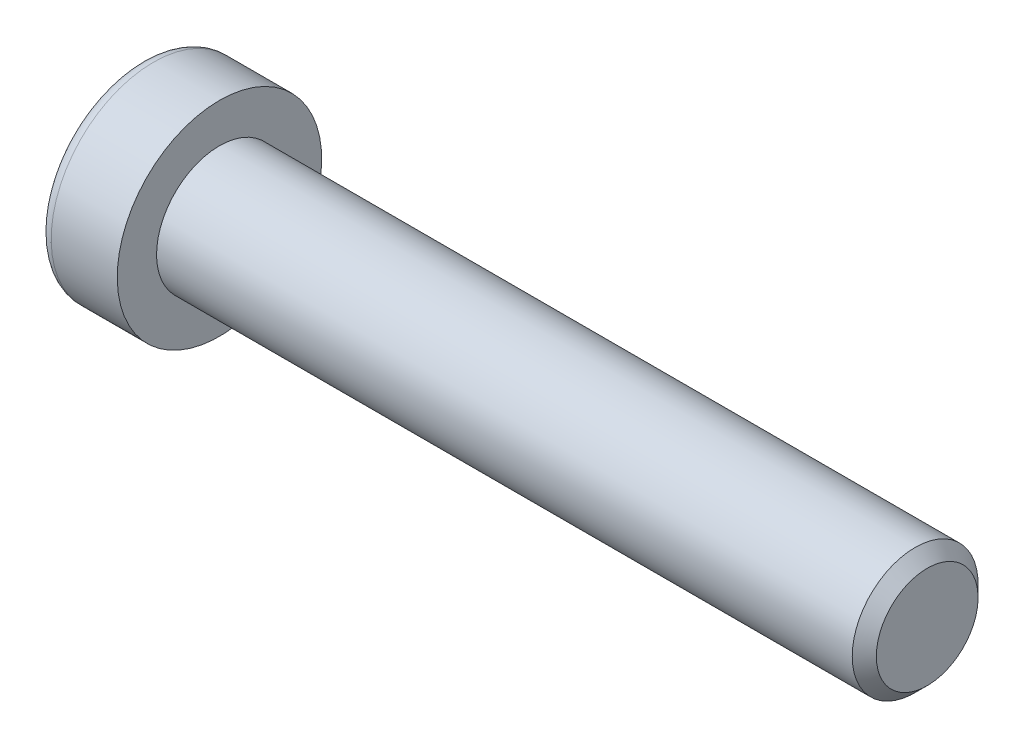
ISO-10303-21;
HEADER;
FILE_DESCRIPTION(('STEP AP214'),'2;1');
FILE_NAME('part.step','',(''),(''),'','','');
FILE_SCHEMA(('AUTOMOTIVE_DESIGN { 1 0 10303 214 1 1 1 1 }'));
ENDSEC;
DATA;
#1=APPLICATION_CONTEXT('core data for automotive mechanical design processes');
#2=APPLICATION_PROTOCOL_DEFINITION('international standard','automotive_design',2000,#1);
#3=PRODUCT_CONTEXT('',#1,'mechanical');
#4=PRODUCT('Part','Part','',(#3));
#5=PRODUCT_RELATED_PRODUCT_CATEGORY('part','',(#4));
#6=PRODUCT_DEFINITION_FORMATION('','',#4);
#7=PRODUCT_DEFINITION_CONTEXT('part definition',#1,'design');
#8=PRODUCT_DEFINITION('design','',#6,#7);
#9=PRODUCT_DEFINITION_SHAPE('','',#8);
#10=(LENGTH_UNIT() NAMED_UNIT(*) SI_UNIT(.MILLI.,.METRE.));
#11=(NAMED_UNIT(*) PLANE_ANGLE_UNIT() SI_UNIT($,.RADIAN.));
#12=(NAMED_UNIT(*) SI_UNIT($,.STERADIAN.) SOLID_ANGLE_UNIT());
#13=UNCERTAINTY_MEASURE_WITH_UNIT(LENGTH_MEASURE(1.E-05),#10,'distance_accuracy_value','');
#14=(GEOMETRIC_REPRESENTATION_CONTEXT(3) GLOBAL_UNCERTAINTY_ASSIGNED_CONTEXT((#13)) GLOBAL_UNIT_ASSIGNED_CONTEXT((#10,
#11,#12)) REPRESENTATION_CONTEXT('',''));
#15=CARTESIAN_POINT('',(0.,0.,0.));
#16=DIRECTION('',(0.,0.,1.));
#17=DIRECTION('',(1.,0.,0.));
#18=AXIS2_PLACEMENT_3D('',#15,#16,#17);
#19=CARTESIAN_POINT('',(-1.21000000177673,0.,0.));
#20=DIRECTION('',(-1.,0.,0.));
#21=DIRECTION('',(0.,0.,1.));
#22=AXIS2_PLACEMENT_3D('',#19,#20,#21);
#23=CONICAL_SURFACE('',#22,2.9040718530382,1.04719754996794);
#24=CARTESIAN_POINT('',(0.466666669012739,-1.13686837721616E-10,0.));
#25=VERTEX_POINT('',#24);
#26=VERTEX_LOOP('',#25);
#27=FACE_BOUND('',#26,.T.);
#28=CARTESIAN_POINT('',(-1.20000000188032,2.50000000042828,1.44337567243126));
#29=CARTESIAN_POINT('',(-1.16336943336427,2.50000000015382,1.31652043353318));
#30=CARTESIAN_POINT('',(-1.13005584831707,2.50000000004123,1.18857018203745));
#31=CARTESIAN_POINT('',(-1.07190798610144,2.49999999995868,0.930454306037677));
#32=CARTESIAN_POINT('',(-1.04709427719735,2.49999999998906,0.800284096806924));
#33=CARTESIAN_POINT('',(-1.00846995036617,2.50000000001067,0.541556812494233));
#34=CARTESIAN_POINT('',(-0.994402236162447,2.50000000000284,0.413039534770439));
#35=CARTESIAN_POINT('',(-0.977611461824864,2.49999999999716,0.155400578562858));
#36=CARTESIAN_POINT('',(-0.974874494142074,2.49999999999929,0.0262798358840899));
#37=CARTESIAN_POINT('',(-0.980582864422355,2.50000000000062,-0.21496841995549));
#38=CARTESIAN_POINT('',(-0.987626608278002,2.50000000000017,-0.327132134383147));
#39=CARTESIAN_POINT('',(-1.00994662771906,2.49999999999983,-0.550728853222557));
#40=CARTESIAN_POINT('',(-1.02523052031715,2.49999999999995,-0.66216108485018));
#41=CARTESIAN_POINT('',(-1.06343729360609,2.50000000000005,-0.886218434015897));
#42=CARTESIAN_POINT('',(-1.08652205474861,2.50000000000003,-0.998815208377872));
#43=CARTESIAN_POINT('',(-1.13891470311393,2.49999999999998,-1.2223298619213));
#44=CARTESIAN_POINT('',(-1.16821028805135,2.49999999999995,-1.33325060237494));
#45=CARTESIAN_POINT('',(-1.20000000215881,2.5,-1.44337567242466));
#46=B_SPLINE_CURVE_WITH_KNOTS('',3,(#28,#29,#30,#31,#32,#33,#34,#35,#36,#37,#38,#39,#40,#41,#42,
#43,#44,#45),.UNSPECIFIED.,.F.,.F.,(4,2,2,2,2,2,2,2,4),(0.,0.396270014515872,0.793492271437725,
1.18088450788727,1.56780111135406,1.90463472821334,2.24178024186127,2.58640202744164,
2.93034746593166),.UNSPECIFIED.);
#47=CARTESIAN_POINT('',(-1.20000000213914,2.49999999973261,1.44337567281968));
#48=VERTEX_POINT('',#47);
#49=CARTESIAN_POINT('',(-1.20000000222827,2.5,-1.44337567266531));
#50=VERTEX_POINT('',#49);
#51=EDGE_CURVE('E19',#48,#50,#46,.T.);
#52=ORIENTED_EDGE('',*,*,#51,.T.);
#53=CARTESIAN_POINT('',(-1.20000000188032,2.49999999974405,-1.44337567361636));
#54=CARTESIAN_POINT('',(-1.16336943336427,2.39014014011794,-1.50680329282772));
#55=CARTESIAN_POINT('',(-1.13005584831707,2.27933197184574,-1.57077841847808));
#56=CARTESIAN_POINT('',(-1.07190798610144,2.05579706606859,-1.69983635640647));
#57=CARTESIAN_POINT('',(-1.04709427719735,1.94306635807401,-1.76492146104816));
#58=CARTESIAN_POINT('',(-1.00846995036617,1.71900195721787,-1.89428510322322));
#59=CARTESIAN_POINT('',(-0.994402236162446,1.60770272987993,-1.95854374207834));
#60=CARTESIAN_POINT('',(-0.977611461824863,1.38458084879682,-2.08736322017721));
#61=CARTESIAN_POINT('',(-0.974874494142074,1.27275900548255,-2.15192359151843));
#62=CARTESIAN_POINT('',(-0.980582864422354,1.06383188730746,-2.27254771943938));
#63=CARTESIAN_POINT('',(-0.987626608278001,0.966695261230055,-2.32862957665281));
#64=CARTESIAN_POINT('',(-1.00994662771905,0.773054822512112,-2.44042793607223));
#65=CARTESIAN_POINT('',(-1.02523052031715,0.676551679122258,-2.49614405188614));
#66=CARTESIAN_POINT('',(-1.06343729360609,0.482512322840195,-2.60817272646909));
#67=CARTESIAN_POINT('',(-1.08652205474861,0.385000655858529,-2.66447111365005));
#68=CARTESIAN_POINT('',(-1.13891470311393,0.191431287771819,-2.77622844042172));
#69=CARTESIAN_POINT('',(-1.16821028805135,0.09537110873237,-2.83168881064853));
#70=CARTESIAN_POINT('',(-1.20000000215881,4.75795613603965E-10,-2.88675134567343));
#71=B_SPLINE_CURVE_WITH_KNOTS('',3,(#53,#54,#55,#56,#57,#58,#59,#60,#61,#62,#63,#64,#65,#66,#67,
#68,#69,#70),.UNSPECIFIED.,.F.,.F.,(4,2,2,2,2,2,2,2,4),(0.,0.396270014515872,0.793492271437724,
1.18088450788727,1.56780111135406,1.90463472821334,2.24178024186127,2.58640202744164,
2.93034746593166),.UNSPECIFIED.);
#72=CARTESIAN_POINT('',(-1.20000000213914,0.,-2.88675134563937));
#73=VERTEX_POINT('',#72);
#74=EDGE_CURVE('E79',#50,#73,#71,.T.);
#75=ORIENTED_EDGE('',*,*,#74,.T.);
#76=CARTESIAN_POINT('',(-1.20000000188032,-6.84219602518767E-10,-2.88675134604762));
#77=CARTESIAN_POINT('',(-1.16336943336427,-0.109859860035873,-2.8233237263609));
#78=CARTESIAN_POINT('',(-1.13005584831707,-0.220668028195489,-2.75934860051552));
#79=CARTESIAN_POINT('',(-1.07190798610144,-0.444202933890087,-2.63029066244415));
#80=CARTESIAN_POINT('',(-1.04709427719735,-0.556933641915047,-2.56520555785509));
#81=CARTESIAN_POINT('',(-1.00846995036617,-0.780998042792801,-2.43584191571745));
#82=CARTESIAN_POINT('',(-0.994402236162447,-0.892297270122914,-2.37158327684878));
#83=CARTESIAN_POINT('',(-0.977611461824864,-1.11541915120034,-2.24276379874007));
#84=CARTESIAN_POINT('',(-0.974874494142073,-1.22724099451673,-2.17820342740253));
#85=CARTESIAN_POINT('',(-0.980582864422354,-1.43616811269316,-2.05757929948389));
#86=CARTESIAN_POINT('',(-0.987626608278001,-1.53330473877011,-2.00149744226967));
#87=CARTESIAN_POINT('',(-1.00994662771906,-1.72694517748772,-1.88969908284967));
#88=CARTESIAN_POINT('',(-1.02523052031715,-1.82344832087769,-1.83398296703597));
#89=CARTESIAN_POINT('',(-1.06343729360609,-2.01748767715985,-1.72195429245319));
#90=CARTESIAN_POINT('',(-1.08652205474861,-2.1149993441415,-1.66565590527218));
#91=CARTESIAN_POINT('',(-1.13891470311393,-2.30856871222816,-1.55389857850043));
#92=CARTESIAN_POINT('',(-1.16821028805135,-2.40462889126758,-1.49843820827358));
#93=CARTESIAN_POINT('',(-1.20000000215881,-2.49999999952421,-1.44337567324877));
#94=B_SPLINE_CURVE_WITH_KNOTS('',3,(#76,#77,#78,#79,#80,#81,#82,#83,#84,#85,#86,#87,#88,#89,#90,
#91,#92,#93),.UNSPECIFIED.,.F.,.F.,(4,2,2,2,2,2,2,2,4),(0.,0.396270014515872,0.793492271437725,
1.18088450788727,1.56780111135406,1.90463472821334,2.24178024186127,2.58640202744164,
2.93034746593167),.UNSPECIFIED.);
#95=CARTESIAN_POINT('',(-1.20000000213914,-2.49999999973261,-1.44337567281968));
#96=VERTEX_POINT('',#95);
#97=EDGE_CURVE('E104',#73,#96,#94,.T.);
#98=ORIENTED_EDGE('',*,*,#97,.T.);
#99=CARTESIAN_POINT('',(-1.20000000188032,-2.50000000042828,-1.44337567243126));
#100=CARTESIAN_POINT('',(-1.16336943336427,-2.50000000015382,-1.31652043353318));
#101=CARTESIAN_POINT('',(-1.13005584831707,-2.50000000004123,-1.18857018203745));
#102=CARTESIAN_POINT('',(-1.07190798610144,-2.49999999995868,-0.93045430603768));
#103=CARTESIAN_POINT('',(-1.04709427719735,-2.49999999998906,-0.800284096806928));
#104=CARTESIAN_POINT('',(-1.00846995036617,-2.50000000001067,-0.541556812494236));
#105=CARTESIAN_POINT('',(-0.994402236162447,-2.50000000000284,-0.413039534770443));
#106=CARTESIAN_POINT('',(-0.977611461824863,-2.49999999999716,-0.155400578562862));
#107=CARTESIAN_POINT('',(-0.974874494142073,-2.49999999999929,-0.0262798358840941));
#108=CARTESIAN_POINT('',(-0.980582864422354,-2.50000000000062,0.214968419955486));
#109=CARTESIAN_POINT('',(-0.987626608278001,-2.50000000000017,0.327132134383144));
#110=CARTESIAN_POINT('',(-1.00994662771905,-2.49999999999983,0.550728853222554));
#111=CARTESIAN_POINT('',(-1.02523052031715,-2.49999999999995,0.662161084850177));
#112=CARTESIAN_POINT('',(-1.06343729360609,-2.50000000000005,0.886218434015895));
#113=CARTESIAN_POINT('',(-1.08652205474861,-2.50000000000002,0.99881520837787));
#114=CARTESIAN_POINT('',(-1.13891470311393,-2.49999999999998,1.2223298619213));
#115=CARTESIAN_POINT('',(-1.16821028805135,-2.49999999999995,1.33325060237494));
#116=CARTESIAN_POINT('',(-1.20000000215881,-2.5,1.44337567242466));
#117=B_SPLINE_CURVE_WITH_KNOTS('',3,(#99,#100,#101,#102,#103,#104,#105,#106,#107,#108,#109,#110,
#111,#112,#113,#114,#115,#116),.UNSPECIFIED.,.F.,.F.,(4,2,2,2,2,2,2,2,4),(0.,0.396270014515872,
0.793492271437724,1.18088450788727,1.56780111135406,1.90463472821334,2.24178024186127,
2.58640202744164,2.93034746593167),.UNSPECIFIED.);
#118=CARTESIAN_POINT('',(-1.20000000213914,-2.49999999973261,1.44337567281969));
#119=VERTEX_POINT('',#118);
#120=EDGE_CURVE('E128',#96,#119,#117,.T.);
#121=ORIENTED_EDGE('',*,*,#120,.T.);
#122=CARTESIAN_POINT('',(-1.20000000188032,-2.49999999974406,1.44337567361636));
#123=CARTESIAN_POINT('',(-1.16336943336427,-2.39014014011795,1.50680329282772));
#124=CARTESIAN_POINT('',(-1.13005584831707,-2.27933197184574,1.57077841847807));
#125=CARTESIAN_POINT('',(-1.07190798610144,-2.05579706606859,1.69983635640647));
#126=CARTESIAN_POINT('',(-1.04709427719735,-1.94306635807401,1.76492146104816));
#127=CARTESIAN_POINT('',(-1.00846995036617,-1.71900195721787,1.89428510322322));
#128=CARTESIAN_POINT('',(-0.994402236162447,-1.60770272987993,1.95854374207834));
#129=CARTESIAN_POINT('',(-0.977611461824864,-1.38458084879682,2.08736322017721));
#130=CARTESIAN_POINT('',(-0.974874494142074,-1.27275900548255,2.15192359151843));
#131=CARTESIAN_POINT('',(-0.980582864422354,-1.06383188730746,2.27254771943938));
#132=CARTESIAN_POINT('',(-0.987626608278001,-0.966695261230056,2.32862957665281));
#133=CARTESIAN_POINT('',(-1.00994662771905,-0.773054822512113,2.44042793607223));
#134=CARTESIAN_POINT('',(-1.02523052031715,-0.676551679122259,2.49614405188614));
#135=CARTESIAN_POINT('',(-1.06343729360609,-0.482512322840196,2.60817272646909));
#136=CARTESIAN_POINT('',(-1.08652205474861,-0.385000655858529,2.66447111365005));
#137=CARTESIAN_POINT('',(-1.13891470311393,-0.19143128777182,2.77622844042172));
#138=CARTESIAN_POINT('',(-1.16821028805135,-0.0953711087323703,2.83168881064852));
#139=CARTESIAN_POINT('',(-1.20000000215881,-4.75795563263291E-10,2.88675134567343));
#140=B_SPLINE_CURVE_WITH_KNOTS('',3,(#122,#123,#124,#125,#126,#127,#128,#129,#130,#131,#132,
#133,#134,#135,#136,#137,#138,#139),.UNSPECIFIED.,.F.,.F.,(4,2,2,2,2,2,2,2,4),(0.,
0.396270014515872,0.793492271437724,1.18088450788727,1.56780111135406,1.90463472821334,
2.24178024186127,2.58640202744164,2.93034746593167),.UNSPECIFIED.);
#141=CARTESIAN_POINT('',(-1.20000000213914,0.,2.88675134563937));
#142=VERTEX_POINT('',#141);
#143=EDGE_CURVE('E136',#119,#142,#140,.T.);
#144=ORIENTED_EDGE('',*,*,#143,.T.);
#145=CARTESIAN_POINT('',(-1.20000000188032,6.84218568158567E-10,2.88675134604763));
#146=CARTESIAN_POINT('',(-1.16336943336427,0.109859860035872,2.8233237263609));
#147=CARTESIAN_POINT('',(-1.13005584831707,0.220668028195487,2.75934860051552));
#148=CARTESIAN_POINT('',(-1.07190798610144,0.444202933890086,2.63029066244415));
#149=CARTESIAN_POINT('',(-1.04709427719735,0.556933641915045,2.56520555785509));
#150=CARTESIAN_POINT('',(-1.00846995036617,0.7809980427928,2.43584191571745));
#151=CARTESIAN_POINT('',(-0.994402236162446,0.892297270122912,2.37158327684878));
#152=CARTESIAN_POINT('',(-0.977611461824863,1.11541915120034,2.24276379874007));
#153=CARTESIAN_POINT('',(-0.974874494142073,1.22724099451673,2.17820342740253));
#154=CARTESIAN_POINT('',(-0.980582864422353,1.43616811269316,2.05757929948389));
#155=CARTESIAN_POINT('',(-0.987626608278,1.53330473877011,2.00149744226967));
#156=CARTESIAN_POINT('',(-1.00994662771905,1.72694517748772,1.88969908284967));
#157=CARTESIAN_POINT('',(-1.02523052031715,1.82344832087769,1.83398296703596));
#158=CARTESIAN_POINT('',(-1.06343729360609,2.01748767715985,1.72195429245319));
#159=CARTESIAN_POINT('',(-1.08652205474861,2.1149993441415,1.66565590527218));
#160=CARTESIAN_POINT('',(-1.13891470311393,2.30856871222816,1.55389857850042));
#161=CARTESIAN_POINT('',(-1.16821028805135,2.40462889126758,1.49843820827358));
#162=CARTESIAN_POINT('',(-1.2000000021588,2.49999999952421,1.44337567324876));
#163=B_SPLINE_CURVE_WITH_KNOTS('',3,(#145,#146,#147,#148,#149,#150,#151,#152,#153,#154,#155,
#156,#157,#158,#159,#160,#161,#162),.UNSPECIFIED.,.F.,.F.,(4,2,2,2,2,2,2,2,4),(0.,
0.396270014515872,0.793492271437725,1.18088450788727,1.56780111135406,1.90463472821334,
2.24178024186127,2.58640202744164,2.93034746593167),.UNSPECIFIED.);
#164=EDGE_CURVE('E81',#142,#48,#163,.T.);
#165=ORIENTED_EDGE('',*,*,#164,.T.);
#166=EDGE_LOOP('',(#52,#75,#98,#121,#144,#165));
#167=FACE_BOUND('',#166,.T.);
#168=ADVANCED_FACE('F15',(#27,#167),#23,.F.);
#169=CARTESIAN_POINT('',(-5.,2.5,1.44337567297406));
#170=DIRECTION('',(0.,1.,0.));
#171=DIRECTION('',(0.,0.,1.));
#172=AXIS2_PLACEMENT_3D('',#169,#170,#171);
#173=PLANE('',#172);
#174=DIRECTION('',(1.,0.,0.));
#175=VECTOR('',#174,1.);
#176=CARTESIAN_POINT('',(-5.,2.5,1.44337567297406));
#177=LINE('',#176,#175);
#178=CARTESIAN_POINT('',(-5.,2.5,1.44337567297406));
#179=VERTEX_POINT('',#178);
#180=EDGE_CURVE('E83',#48,#179,#177,.F.);
#181=ORIENTED_EDGE('',*,*,#180,.T.);
#182=DIRECTION('',(0.,0.,1.));
#183=VECTOR('',#182,1.);
#184=CARTESIAN_POINT('',(-5.,2.5,0.));
#185=LINE('',#184,#183);
#186=CARTESIAN_POINT('',(-5.,2.5,-1.44337567297407));
#187=VERTEX_POINT('',#186);
#188=EDGE_CURVE('E88',#187,#179,#185,.T.);
#189=ORIENTED_EDGE('',*,*,#188,.F.);
#190=DIRECTION('',(1.,0.,0.));
#191=VECTOR('',#190,1.);
#192=CARTESIAN_POINT('',(-5.,2.5,-1.44337567297407));
#193=LINE('',#192,#191);
#194=EDGE_CURVE('E86',#187,#50,#193,.T.);
#195=ORIENTED_EDGE('',*,*,#194,.T.);
#196=ORIENTED_EDGE('',*,*,#51,.F.);
#197=EDGE_LOOP('',(#181,#189,#195,#196));
#198=FACE_BOUND('',#197,.T.);
#199=ADVANCED_FACE('F75',(#198),#173,.F.);
#200=CARTESIAN_POINT('',(-5.,0.,2.88675134594813));
#201=DIRECTION('',(0.,0.500000000000001,0.866025403784438));
#202=DIRECTION('',(0.,-0.866025403784438,0.500000000000001));
#203=AXIS2_PLACEMENT_3D('',#200,#201,#202);
#204=PLANE('',#203);
#205=DIRECTION('',(1.,0.,0.));
#206=VECTOR('',#205,1.);
#207=CARTESIAN_POINT('',(-5.,0.,2.88675134594813));
#208=LINE('',#207,#206);
#209=CARTESIAN_POINT('',(-5.,0.,2.88675134594813));
#210=VERTEX_POINT('',#209);
#211=EDGE_CURVE('E140',#142,#210,#208,.F.);
#212=ORIENTED_EDGE('',*,*,#211,.T.);
#213=DIRECTION('',(0.,-0.866025403784438,0.500000000000001));
#214=VECTOR('',#213,1.);
#215=CARTESIAN_POINT('',(-5.,2.5,1.44337567297406));
#216=LINE('',#215,#214);
#217=EDGE_CURVE('E94',#179,#210,#216,.T.);
#218=ORIENTED_EDGE('',*,*,#217,.F.);
#219=ORIENTED_EDGE('',*,*,#180,.F.);
#220=ORIENTED_EDGE('',*,*,#164,.F.);
#221=EDGE_LOOP('',(#212,#218,#219,#220));
#222=FACE_BOUND('',#221,.T.);
#223=ADVANCED_FACE('F144',(#222),#204,.F.);
#224=CARTESIAN_POINT('',(-5.,-2.5,1.44337567297406));
#225=DIRECTION('',(0.,-0.5,0.866025403784439));
#226=DIRECTION('',(0.,-0.866025403784439,-0.5));
#227=AXIS2_PLACEMENT_3D('',#224,#225,#226);
#228=PLANE('',#227);
#229=DIRECTION('',(1.,0.,0.));
#230=VECTOR('',#229,1.);
#231=CARTESIAN_POINT('',(-5.,-2.5,1.44337567297406));
#232=LINE('',#231,#230);
#233=CARTESIAN_POINT('',(-5.,-2.5,1.44337567297406));
#234=VERTEX_POINT('',#233);
#235=EDGE_CURVE('E135',#119,#234,#232,.F.);
#236=ORIENTED_EDGE('',*,*,#235,.T.);
#237=DIRECTION('',(0.,-0.866025403784439,-0.5));
#238=VECTOR('',#237,1.);
#239=CARTESIAN_POINT('',(-5.,0.,2.88675134594813));
#240=LINE('',#239,#238);
#241=EDGE_CURVE('E223',#210,#234,#240,.T.);
#242=ORIENTED_EDGE('',*,*,#241,.F.);
#243=ORIENTED_EDGE('',*,*,#211,.F.);
#244=ORIENTED_EDGE('',*,*,#143,.F.);
#245=EDGE_LOOP('',(#236,#242,#243,#244));
#246=FACE_BOUND('',#245,.T.);
#247=ADVANCED_FACE('F124',(#246),#228,.F.);
#248=CARTESIAN_POINT('',(-5.,-2.5,-1.44337567297406));
#249=DIRECTION('',(0.,-1.,0.));
#250=DIRECTION('',(0.,0.,-1.));
#251=AXIS2_PLACEMENT_3D('',#248,#249,#250);
#252=PLANE('',#251);
#253=DIRECTION('',(1.,0.,0.));
#254=VECTOR('',#253,1.);
#255=CARTESIAN_POINT('',(-5.,-2.5,-1.44337567297406));
#256=LINE('',#255,#254);
#257=CARTESIAN_POINT('',(-5.,-2.5,-1.44337567297406));
#258=VERTEX_POINT('',#257);
#259=EDGE_CURVE('E134',#96,#258,#256,.F.);
#260=ORIENTED_EDGE('',*,*,#259,.T.);
#261=DIRECTION('',(0.,0.,1.));
#262=VECTOR('',#261,1.);
#263=CARTESIAN_POINT('',(-5.,-2.5,0.));
#264=LINE('',#263,#262);
#265=EDGE_CURVE('E220',#234,#258,#264,.F.);
#266=ORIENTED_EDGE('',*,*,#265,.F.);
#267=ORIENTED_EDGE('',*,*,#235,.F.);
#268=ORIENTED_EDGE('',*,*,#120,.F.);
#269=EDGE_LOOP('',(#260,#266,#267,#268));
#270=FACE_BOUND('',#269,.T.);
#271=ADVANCED_FACE('F120',(#270),#252,.F.);
#272=CARTESIAN_POINT('',(-5.,0.,-2.88675134594813));
#273=DIRECTION('',(0.,-0.5,-0.866025403784439));
#274=DIRECTION('',(0.,0.866025403784439,-0.5));
#275=AXIS2_PLACEMENT_3D('',#272,#273,#274);
#276=PLANE('',#275);
#277=DIRECTION('',(1.,0.,0.));
#278=VECTOR('',#277,1.);
#279=CARTESIAN_POINT('',(-5.,0.,-2.88675134594813));
#280=LINE('',#279,#278);
#281=CARTESIAN_POINT('',(-5.,0.,-2.88675134594813));
#282=VERTEX_POINT('',#281);
#283=EDGE_CURVE('E37',#73,#282,#280,.F.);
#284=ORIENTED_EDGE('',*,*,#283,.T.);
#285=DIRECTION('',(0.,0.866025403784438,-0.500000000000001));
#286=VECTOR('',#285,1.);
#287=CARTESIAN_POINT('',(-5.,-2.5,-1.44337567297406));
#288=LINE('',#287,#286);
#289=EDGE_CURVE('E217',#258,#282,#288,.T.);
#290=ORIENTED_EDGE('',*,*,#289,.F.);
#291=ORIENTED_EDGE('',*,*,#259,.F.);
#292=ORIENTED_EDGE('',*,*,#97,.F.);
#293=EDGE_LOOP('',(#284,#290,#291,#292));
#294=FACE_BOUND('',#293,.T.);
#295=ADVANCED_FACE('F114',(#294),#276,.F.);
#296=CARTESIAN_POINT('',(-5.,2.5,-1.44337567297407));
#297=DIRECTION('',(0.,0.5,-0.866025403784439));
#298=DIRECTION('',(0.,0.866025403784439,0.5));
#299=AXIS2_PLACEMENT_3D('',#296,#297,#298);
#300=PLANE('',#299);
#301=ORIENTED_EDGE('',*,*,#194,.F.);
#302=DIRECTION('',(0.,0.866025403784439,0.5));
#303=VECTOR('',#302,1.);
#304=CARTESIAN_POINT('',(-5.,0.,-2.88675134594813));
#305=LINE('',#304,#303);
#306=EDGE_CURVE('E215',#282,#187,#305,.T.);
#307=ORIENTED_EDGE('',*,*,#306,.F.);
#308=ORIENTED_EDGE('',*,*,#283,.F.);
#309=ORIENTED_EDGE('',*,*,#74,.F.);
#310=EDGE_LOOP('',(#301,#307,#308,#309));
#311=FACE_BOUND('',#310,.T.);
#312=ADVANCED_FACE('F92',(#311),#300,.F.);
#313=CARTESIAN_POINT('',(-5.,4.69337567297407,0.));
#314=DIRECTION('',(-1.,0.,0.));
#315=DIRECTION('',(0.,0.,1.));
#316=AXIS2_PLACEMENT_3D('',#313,#314,#315);
#317=PLANE('',#316);
#318=ORIENTED_EDGE('',*,*,#289,.T.);
#319=ORIENTED_EDGE('',*,*,#306,.T.);
#320=ORIENTED_EDGE('',*,*,#188,.T.);
#321=ORIENTED_EDGE('',*,*,#217,.T.);
#322=ORIENTED_EDGE('',*,*,#241,.T.);
#323=ORIENTED_EDGE('',*,*,#265,.T.);
#324=EDGE_LOOP('',(#318,#319,#320,#321,#322,#323));
#325=FACE_BOUND('',#324,.T.);
#326=CARTESIAN_POINT('',(-5.,0.,0.));
#327=DIRECTION('',(1.,0.,0.));
#328=DIRECTION('',(0.,1.,0.));
#329=AXIS2_PLACEMENT_3D('',#326,#327,#328);
#330=CIRCLE('',#329,5.7);
#331=CARTESIAN_POINT('',(-5.,5.7,0.));
#332=VERTEX_POINT('',#331);
#333=EDGE_CURVE('E192',#332,#332,#330,.T.);
#334=ORIENTED_EDGE('',*,*,#333,.F.);
#335=EDGE_LOOP('',(#334));
#336=FACE_BOUND('',#335,.T.);
#337=ADVANCED_FACE('F113',(#325,#336),#317,.T.);
#338=CARTESIAN_POINT('',(-4.2,0.,0.));
#339=DIRECTION('',(1.,0.,0.));
#340=DIRECTION('',(0.,0.,-1.));
#341=AXIS2_PLACEMENT_3D('',#338,#339,#340);
#342=TOROIDAL_SURFACE('',#341,5.7,0.8);
#343=CARTESIAN_POINT('',(-4.2,0.,0.));
#344=DIRECTION('',(1.,0.,0.));
#345=DIRECTION('',(0.,1.,0.));
#346=AXIS2_PLACEMENT_3D('',#343,#344,#345);
#347=CIRCLE('',#346,6.5);
#348=CARTESIAN_POINT('',(-4.2,6.5,0.));
#349=VERTEX_POINT('',#348);
#350=EDGE_CURVE('E233',#349,#349,#347,.T.);
#351=ORIENTED_EDGE('',*,*,#350,.F.);
#352=EDGE_LOOP('',(#351));
#353=FACE_BOUND('',#352,.T.);
#354=ORIENTED_EDGE('',*,*,#333,.T.);
#355=EDGE_LOOP('',(#354));
#356=FACE_BOUND('',#355,.T.);
#357=ADVANCED_FACE('F176',(#353,#356),#342,.T.);
#358=CARTESIAN_POINT('',(-2.5,0.,0.));
#359=DIRECTION('',(1.,0.,0.));
#360=DIRECTION('',(0.,1.,0.));
#361=AXIS2_PLACEMENT_3D('',#358,#359,#360);
#362=CYLINDRICAL_SURFACE('',#361,6.5);
#363=ORIENTED_EDGE('',*,*,#350,.T.);
#364=EDGE_LOOP('',(#363));
#365=FACE_BOUND('',#364,.T.);
#366=CARTESIAN_POINT('',(0.,0.,0.));
#367=DIRECTION('',(1.,0.,0.));
#368=DIRECTION('',(0.,1.,0.));
#369=AXIS2_PLACEMENT_3D('',#366,#367,#368);
#370=CIRCLE('',#369,6.5);
#371=CARTESIAN_POINT('',(0.,6.5,0.));
#372=VERTEX_POINT('',#371);
#373=EDGE_CURVE('E102',#372,#372,#370,.T.);
#374=ORIENTED_EDGE('',*,*,#373,.F.);
#375=EDGE_LOOP('',(#374));
#376=FACE_BOUND('',#375,.T.);
#377=ADVANCED_FACE('F173',(#365,#376),#362,.T.);
#378=CARTESIAN_POINT('',(45.,2.,0.));
#379=DIRECTION('',(1.,0.,0.));
#380=DIRECTION('',(0.,0.,-1.));
#381=AXIS2_PLACEMENT_3D('',#378,#379,#380);
#382=PLANE('',#381);
#383=CARTESIAN_POINT('',(45.000000000357,0.,0.));
#384=DIRECTION('',(-1.,0.,0.));
#385=DIRECTION('',(0.,0.,1.));
#386=AXIS2_PLACEMENT_3D('',#383,#384,#385);
#387=CIRCLE('',#386,3.2331875003706);
#388=CARTESIAN_POINT('',(45.000000000357,0.,3.2331875003706));
#389=VERTEX_POINT('',#388);
#390=EDGE_CURVE('E229',#389,#389,#387,.T.);
#391=ORIENTED_EDGE('',*,*,#390,.F.);
#392=EDGE_LOOP('',(#391));
#393=FACE_BOUND('',#392,.T.);
#394=ADVANCED_FACE('F169',(#393),#382,.T.);
#395=CARTESIAN_POINT('',(0.,5.25,0.));
#396=DIRECTION('',(1.,0.,0.));
#397=DIRECTION('',(0.,0.,-1.));
#398=AXIS2_PLACEMENT_3D('',#395,#396,#397);
#399=PLANE('',#398);
#400=CARTESIAN_POINT('',(0.,0.,0.));
#401=DIRECTION('',(1.,0.,0.));
#402=DIRECTION('',(0.,1.,0.));
#403=AXIS2_PLACEMENT_3D('',#400,#401,#402);
#404=CIRCLE('',#403,4.);
#405=CARTESIAN_POINT('',(0.,4.,0.));
#406=VERTEX_POINT('',#405);
#407=EDGE_CURVE('E28',#406,#406,#404,.T.);
#408=ORIENTED_EDGE('',*,*,#407,.F.);
#409=EDGE_LOOP('',(#408));
#410=FACE_BOUND('',#409,.T.);
#411=ORIENTED_EDGE('',*,*,#373,.T.);
#412=EDGE_LOOP('',(#411));
#413=FACE_BOUND('',#412,.T.);
#414=ADVANCED_FACE('F162',(#410,#413),#399,.T.);
#415=CARTESIAN_POINT('',(44.2331874996285,0.,0.));
#416=DIRECTION('',(-1.,0.,0.));
#417=DIRECTION('',(0.,0.,1.));
#418=AXIS2_PLACEMENT_3D('',#415,#416,#417);
#419=CONICAL_SURFACE('',#418,3.99999999967804,0.78539816247083);
#420=ORIENTED_EDGE('',*,*,#390,.T.);
#421=EDGE_LOOP('',(#420));
#422=FACE_BOUND('',#421,.T.);
#423=CARTESIAN_POINT('',(44.2331875,0.,0.));
#424=DIRECTION('',(1.,0.,0.));
#425=DIRECTION('',(0.,1.,0.));
#426=AXIS2_PLACEMENT_3D('',#423,#424,#425);
#427=CIRCLE('',#426,4.);
#428=CARTESIAN_POINT('',(44.2331875,4.,0.));
#429=VERTEX_POINT('',#428);
#430=EDGE_CURVE('E10',#429,#429,#427,.F.);
#431=ORIENTED_EDGE('',*,*,#430,.F.);
#432=EDGE_LOOP('',(#431));
#433=FACE_BOUND('',#432,.T.);
#434=ADVANCED_FACE('F155',(#422,#433),#419,.T.);
#435=CARTESIAN_POINT('',(34.,0.,0.));
#436=DIRECTION('',(1.,0.,0.));
#437=DIRECTION('',(0.,1.,0.));
#438=AXIS2_PLACEMENT_3D('',#435,#436,#437);
#439=CYLINDRICAL_SURFACE('',#438,4.);
#440=ORIENTED_EDGE('',*,*,#430,.T.);
#441=EDGE_LOOP('',(#440));
#442=FACE_BOUND('',#441,.T.);
#443=ORIENTED_EDGE('',*,*,#407,.T.);
#444=EDGE_LOOP('',(#443));
#445=FACE_BOUND('',#444,.T.);
#446=ADVANCED_FACE('F153',(#442,#445),#439,.T.);
#447=CLOSED_SHELL('',(#168,#199,#223,#247,#271,#295,#312,#337,#357,#377,#394,#414,#434,#446));
#448=MANIFOLD_SOLID_BREP('B1',#447);
#449=ADVANCED_BREP_SHAPE_REPRESENTATION('',(#18,#448),#14);
#450=SHAPE_DEFINITION_REPRESENTATION(#9,#449);
ENDSEC;
END-ISO-10303-21;
